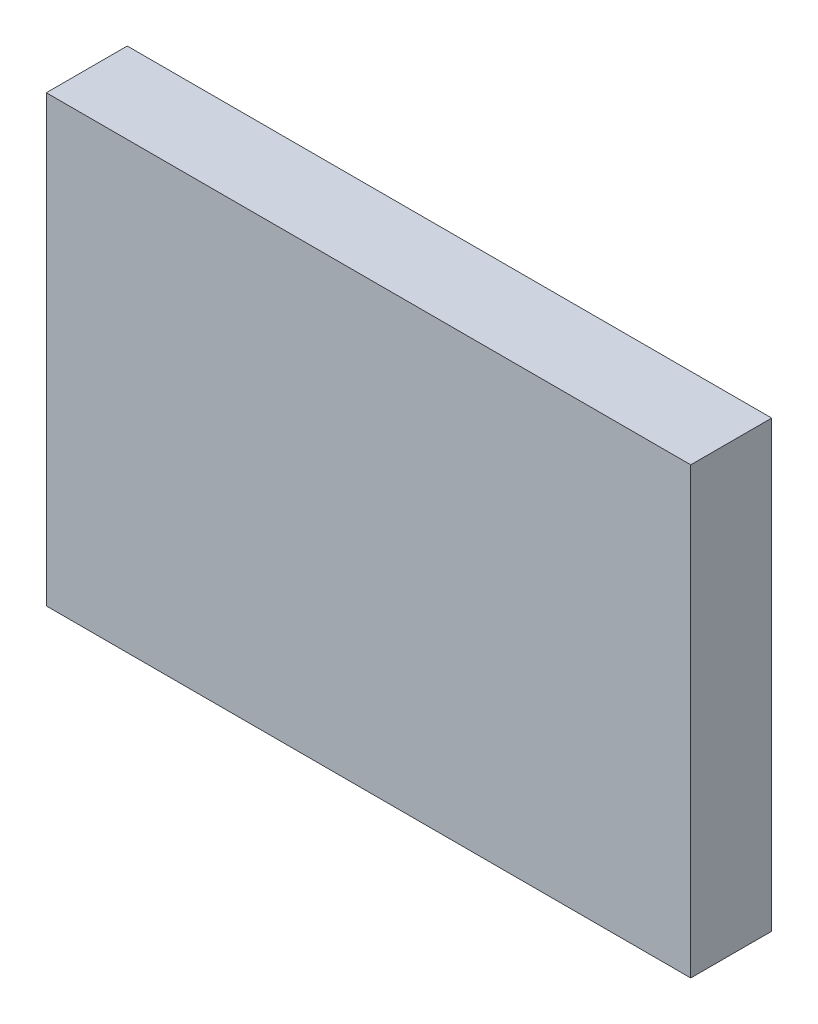
ISO-10303-21;
HEADER;
FILE_DESCRIPTION(('STEP AP214'),'2;1');
FILE_NAME('part.step','',(''),(''),'','','');
FILE_SCHEMA(('AUTOMOTIVE_DESIGN { 1 0 10303 214 1 1 1 1 }'));
ENDSEC;
DATA;
#1=APPLICATION_CONTEXT('core data for automotive mechanical design processes');
#2=APPLICATION_PROTOCOL_DEFINITION('international standard','automotive_design',2000,#1);
#3=PRODUCT_CONTEXT('',#1,'mechanical');
#4=PRODUCT('Part','Part','',(#3));
#5=PRODUCT_RELATED_PRODUCT_CATEGORY('part','',(#4));
#6=PRODUCT_DEFINITION_FORMATION('','',#4);
#7=PRODUCT_DEFINITION_CONTEXT('part definition',#1,'design');
#8=PRODUCT_DEFINITION('design','',#6,#7);
#9=PRODUCT_DEFINITION_SHAPE('','',#8);
#10=(LENGTH_UNIT() NAMED_UNIT(*) SI_UNIT(.MILLI.,.METRE.));
#11=(NAMED_UNIT(*) PLANE_ANGLE_UNIT() SI_UNIT($,.RADIAN.));
#12=(NAMED_UNIT(*) SI_UNIT($,.STERADIAN.) SOLID_ANGLE_UNIT());
#13=UNCERTAINTY_MEASURE_WITH_UNIT(LENGTH_MEASURE(1.E-05),#10,'distance_accuracy_value','');
#14=(GEOMETRIC_REPRESENTATION_CONTEXT(3) GLOBAL_UNCERTAINTY_ASSIGNED_CONTEXT((#13)) GLOBAL_UNIT_ASSIGNED_CONTEXT((#10,
#11,#12)) REPRESENTATION_CONTEXT('',''));
#15=CARTESIAN_POINT('',(0.,0.,0.));
#16=DIRECTION('',(0.,0.,1.));
#17=DIRECTION('',(1.,0.,0.));
#18=AXIS2_PLACEMENT_3D('',#15,#16,#17);
#19=CARTESIAN_POINT('',(1.143,-0.14,0.));
#20=DIRECTION('',(0.,-1.,0.));
#21=DIRECTION('',(0.,0.,-1.));
#22=AXIS2_PLACEMENT_3D('',#19,#20,#21);
#23=PLANE('',#22);
#24=DIRECTION('',(-1.,0.,0.));
#25=VECTOR('',#24,1.);
#26=CARTESIAN_POINT('',(1.549,-0.14,0.));
#27=LINE('',#26,#25);
#28=CARTESIAN_POINT('',(1.549,-0.14,0.));
#29=VERTEX_POINT('',#28);
#30=CARTESIAN_POINT('',(1.143,-0.14,0.));
#31=VERTEX_POINT('',#30);
#32=EDGE_CURVE('E11',#29,#31,#27,.T.);
#33=ORIENTED_EDGE('',*,*,#32,.F.);
#34=DIRECTION('',(0.,0.,-1.));
#35=VECTOR('',#34,1.);
#36=CARTESIAN_POINT('',(1.549,-0.14,0.051));
#37=LINE('',#36,#35);
#38=CARTESIAN_POINT('',(1.549,-0.14,0.051));
#39=VERTEX_POINT('',#38);
#40=EDGE_CURVE('E24',#39,#29,#37,.T.);
#41=ORIENTED_EDGE('',*,*,#40,.F.);
#42=DIRECTION('',(1.,0.,0.));
#43=VECTOR('',#42,1.);
#44=CARTESIAN_POINT('',(1.143,-0.14,0.051));
#45=LINE('',#44,#43);
#46=CARTESIAN_POINT('',(1.143,-0.14,0.051));
#47=VERTEX_POINT('',#46);
#48=EDGE_CURVE('E88',#47,#39,#45,.T.);
#49=ORIENTED_EDGE('',*,*,#48,.F.);
#50=DIRECTION('',(0.,0.,1.));
#51=VECTOR('',#50,1.);
#52=CARTESIAN_POINT('',(1.143,-0.14,0.));
#53=LINE('',#52,#51);
#54=EDGE_CURVE('E77',#31,#47,#53,.T.);
#55=ORIENTED_EDGE('',*,*,#54,.F.);
#56=EDGE_LOOP('',(#33,#41,#49,#55));
#57=FACE_BOUND('',#56,.T.);
#58=ADVANCED_FACE('F17',(#57),#23,.T.);
#59=CARTESIAN_POINT('',(1.549,-0.14,0.));
#60=DIRECTION('',(1.,0.,0.));
#61=DIRECTION('',(0.,1.,0.));
#62=AXIS2_PLACEMENT_3D('',#59,#60,#61);
#63=PLANE('',#62);
#64=DIRECTION('',(0.,-1.,0.));
#65=VECTOR('',#64,1.);
#66=CARTESIAN_POINT('',(1.549,0.14,0.));
#67=LINE('',#66,#65);
#68=CARTESIAN_POINT('',(1.549,0.14,0.));
#69=VERTEX_POINT('',#68);
#70=EDGE_CURVE('E85',#69,#29,#67,.T.);
#71=ORIENTED_EDGE('',*,*,#70,.F.);
#72=DIRECTION('',(0.,0.,-1.));
#73=VECTOR('',#72,1.);
#74=CARTESIAN_POINT('',(1.549,0.14,0.051));
#75=LINE('',#74,#73);
#76=CARTESIAN_POINT('',(1.549,0.14,0.051));
#77=VERTEX_POINT('',#76);
#78=EDGE_CURVE('E83',#77,#69,#75,.T.);
#79=ORIENTED_EDGE('',*,*,#78,.F.);
#80=DIRECTION('',(0.,1.,0.));
#81=VECTOR('',#80,1.);
#82=CARTESIAN_POINT('',(1.549,-0.14,0.051));
#83=LINE('',#82,#81);
#84=EDGE_CURVE('E72',#39,#77,#83,.T.);
#85=ORIENTED_EDGE('',*,*,#84,.F.);
#86=ORIENTED_EDGE('',*,*,#40,.T.);
#87=EDGE_LOOP('',(#71,#79,#85,#86));
#88=FACE_BOUND('',#87,.T.);
#89=ADVANCED_FACE('F90',(#88),#63,.T.);
#90=CARTESIAN_POINT('',(1.549,0.14,0.));
#91=DIRECTION('',(0.,1.,0.));
#92=DIRECTION('',(1.,0.,0.));
#93=AXIS2_PLACEMENT_3D('',#90,#91,#92);
#94=PLANE('',#93);
#95=DIRECTION('',(1.,0.,0.));
#96=VECTOR('',#95,1.);
#97=CARTESIAN_POINT('',(1.143,0.14,0.));
#98=LINE('',#97,#96);
#99=CARTESIAN_POINT('',(1.143,0.14,0.));
#100=VERTEX_POINT('',#99);
#101=EDGE_CURVE('E60',#100,#69,#98,.T.);
#102=ORIENTED_EDGE('',*,*,#101,.F.);
#103=DIRECTION('',(0.,0.,-1.));
#104=VECTOR('',#103,1.);
#105=CARTESIAN_POINT('',(1.143,0.14,0.051));
#106=LINE('',#105,#104);
#107=CARTESIAN_POINT('',(1.143,0.14,0.051));
#108=VERTEX_POINT('',#107);
#109=EDGE_CURVE('E54',#108,#100,#106,.T.);
#110=ORIENTED_EDGE('',*,*,#109,.F.);
#111=DIRECTION('',(-1.,0.,0.));
#112=VECTOR('',#111,1.);
#113=CARTESIAN_POINT('',(1.549,0.14,0.051));
#114=LINE('',#113,#112);
#115=EDGE_CURVE('E58',#77,#108,#114,.T.);
#116=ORIENTED_EDGE('',*,*,#115,.F.);
#117=ORIENTED_EDGE('',*,*,#78,.T.);
#118=EDGE_LOOP('',(#102,#110,#116,#117));
#119=FACE_BOUND('',#118,.T.);
#120=ADVANCED_FACE('F56',(#119),#94,.T.);
#121=CARTESIAN_POINT('',(1.143,0.14,0.));
#122=DIRECTION('',(-1.,0.,0.));
#123=DIRECTION('',(0.,0.,1.));
#124=AXIS2_PLACEMENT_3D('',#121,#122,#123);
#125=PLANE('',#124);
#126=DIRECTION('',(0.,1.,0.));
#127=VECTOR('',#126,1.);
#128=CARTESIAN_POINT('',(1.143,-0.14,0.));
#129=LINE('',#128,#127);
#130=EDGE_CURVE('E73',#31,#100,#129,.T.);
#131=ORIENTED_EDGE('',*,*,#130,.F.);
#132=ORIENTED_EDGE('',*,*,#54,.T.);
#133=DIRECTION('',(0.,-1.,0.));
#134=VECTOR('',#133,1.);
#135=CARTESIAN_POINT('',(1.143,0.14,0.051));
#136=LINE('',#135,#134);
#137=EDGE_CURVE('E70',#108,#47,#136,.T.);
#138=ORIENTED_EDGE('',*,*,#137,.F.);
#139=ORIENTED_EDGE('',*,*,#109,.T.);
#140=EDGE_LOOP('',(#131,#132,#138,#139));
#141=FACE_BOUND('',#140,.T.);
#142=ADVANCED_FACE('F76',(#141),#125,.T.);
#143=CARTESIAN_POINT('',(1.143,0.14,0.));
#144=DIRECTION('',(0.,0.,-1.));
#145=DIRECTION('',(0.,-1.,0.));
#146=AXIS2_PLACEMENT_3D('',#143,#144,#145);
#147=PLANE('',#146);
#148=ORIENTED_EDGE('',*,*,#101,.T.);
#149=ORIENTED_EDGE('',*,*,#70,.T.);
#150=ORIENTED_EDGE('',*,*,#32,.T.);
#151=ORIENTED_EDGE('',*,*,#130,.T.);
#152=EDGE_LOOP('',(#148,#149,#150,#151));
#153=FACE_BOUND('',#152,.T.);
#154=ADVANCED_FACE('F91',(#153),#147,.T.);
#155=CARTESIAN_POINT('',(1.143,-0.14,0.051));
#156=DIRECTION('',(0.,0.,1.));
#157=DIRECTION('',(1.,0.,0.));
#158=AXIS2_PLACEMENT_3D('',#155,#156,#157);
#159=PLANE('',#158);
#160=ORIENTED_EDGE('',*,*,#48,.T.);
#161=ORIENTED_EDGE('',*,*,#84,.T.);
#162=ORIENTED_EDGE('',*,*,#115,.T.);
#163=ORIENTED_EDGE('',*,*,#137,.T.);
#164=EDGE_LOOP('',(#160,#161,#162,#163));
#165=FACE_BOUND('',#164,.T.);
#166=ADVANCED_FACE('F69',(#165),#159,.T.);
#167=CLOSED_SHELL('',(#58,#89,#120,#142,#154,#166));
#168=MANIFOLD_SOLID_BREP('B1',#167);
#169=ADVANCED_BREP_SHAPE_REPRESENTATION('',(#18,#168),#14);
#170=SHAPE_DEFINITION_REPRESENTATION(#9,#169);
ENDSEC;
END-ISO-10303-21;
